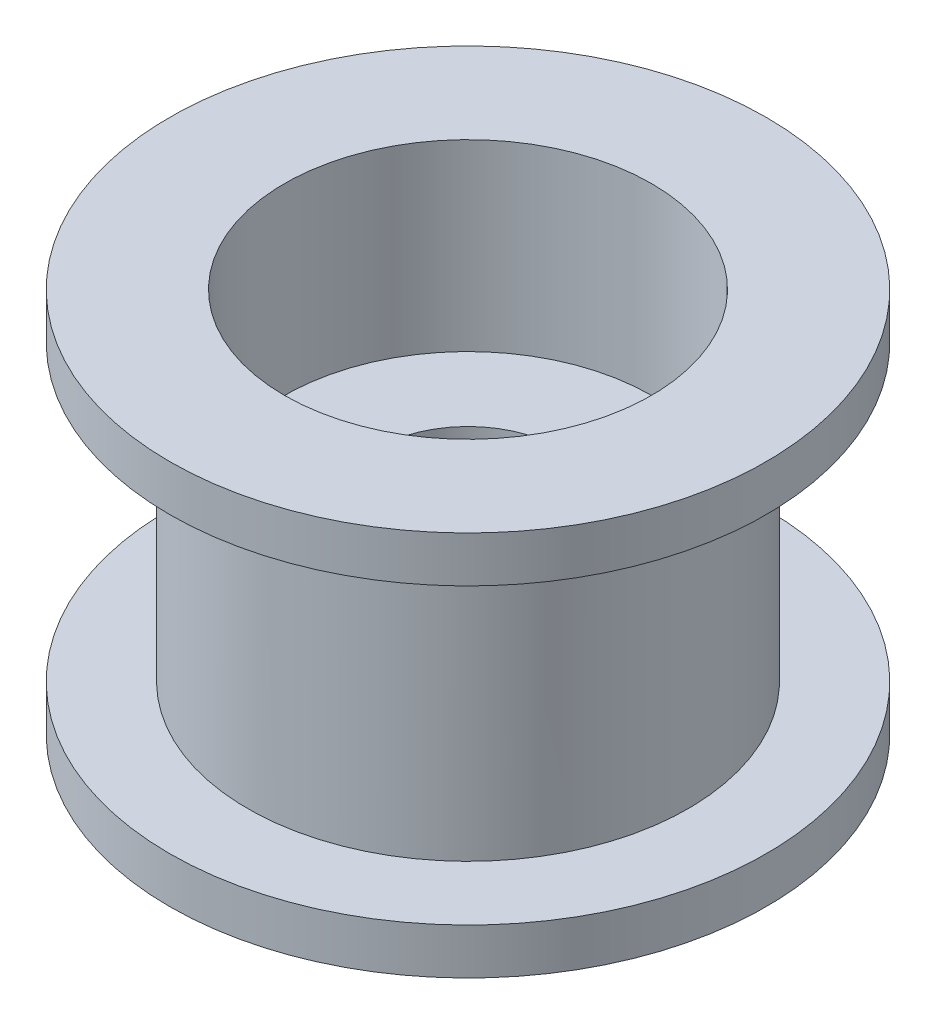
ISO-10303-21;
HEADER;
FILE_DESCRIPTION(('STEP AP214'),'2;1');
FILE_NAME('part.step','',(''),(''),'','','');
FILE_SCHEMA(('AUTOMOTIVE_DESIGN { 1 0 10303 214 1 1 1 1 }'));
ENDSEC;
DATA;
#1=APPLICATION_CONTEXT('core data for automotive mechanical design processes');
#2=APPLICATION_PROTOCOL_DEFINITION('international standard','automotive_design',2000,#1);
#3=PRODUCT_CONTEXT('',#1,'mechanical');
#4=PRODUCT('Part','Part','',(#3));
#5=PRODUCT_RELATED_PRODUCT_CATEGORY('part','',(#4));
#6=PRODUCT_DEFINITION_FORMATION('','',#4);
#7=PRODUCT_DEFINITION_CONTEXT('part definition',#1,'design');
#8=PRODUCT_DEFINITION('design','',#6,#7);
#9=PRODUCT_DEFINITION_SHAPE('','',#8);
#10=(LENGTH_UNIT() NAMED_UNIT(*) SI_UNIT(.MILLI.,.METRE.));
#11=(NAMED_UNIT(*) PLANE_ANGLE_UNIT() SI_UNIT($,.RADIAN.));
#12=(NAMED_UNIT(*) SI_UNIT($,.STERADIAN.) SOLID_ANGLE_UNIT());
#13=UNCERTAINTY_MEASURE_WITH_UNIT(LENGTH_MEASURE(1.E-05),#10,'distance_accuracy_value','');
#14=(GEOMETRIC_REPRESENTATION_CONTEXT(3) GLOBAL_UNCERTAINTY_ASSIGNED_CONTEXT((#13)) GLOBAL_UNIT_ASSIGNED_CONTEXT((#10,
#11,#12)) REPRESENTATION_CONTEXT('',''));
#15=CARTESIAN_POINT('',(0.,0.,0.));
#16=DIRECTION('',(0.,0.,1.));
#17=DIRECTION('',(1.,0.,0.));
#18=AXIS2_PLACEMENT_3D('',#15,#16,#17);
#19=CARTESIAN_POINT('',(0.,-4.2,0.));
#20=DIRECTION('',(0.,-1.,0.));
#21=DIRECTION('',(0.,0.,1.));
#22=AXIS2_PLACEMENT_3D('',#19,#20,#21);
#23=PLANE('',#22);
#24=CARTESIAN_POINT('',(0.,-4.2,0.));
#25=DIRECTION('',(0.,1.,0.));
#26=DIRECTION('',(0.,0.,1.));
#27=AXIS2_PLACEMENT_3D('',#24,#25,#26);
#28=CIRCLE('',#27,6.5);
#29=CARTESIAN_POINT('',(0.,-4.2,6.5));
#30=VERTEX_POINT('',#29);
#31=EDGE_CURVE('E57',#30,#30,#28,.T.);
#32=ORIENTED_EDGE('',*,*,#31,.F.);
#33=EDGE_LOOP('',(#32));
#34=FACE_BOUND('',#33,.T.);
#35=CARTESIAN_POINT('',(0.,-4.2,0.));
#36=DIRECTION('',(0.,1.,0.));
#37=DIRECTION('',(0.,0.,1.));
#38=AXIS2_PLACEMENT_3D('',#35,#36,#37);
#39=CIRCLE('',#38,4.);
#40=CARTESIAN_POINT('',(0.,-4.2,4.));
#41=VERTEX_POINT('',#40);
#42=EDGE_CURVE('E64',#41,#41,#39,.T.);
#43=ORIENTED_EDGE('',*,*,#42,.T.);
#44=EDGE_LOOP('',(#43));
#45=FACE_BOUND('',#44,.T.);
#46=ADVANCED_FACE('F31',(#34,#45),#23,.T.);
#47=CARTESIAN_POINT('',(0.,3.2,0.));
#48=DIRECTION('',(0.,-1.,0.));
#49=DIRECTION('',(0.,0.,-1.));
#50=AXIS2_PLACEMENT_3D('',#47,#48,#49);
#51=CYLINDRICAL_SURFACE('',#50,4.8);
#52=CARTESIAN_POINT('',(0.,3.2,0.));
#53=DIRECTION('',(0.,1.,0.));
#54=DIRECTION('',(0.,0.,1.));
#55=AXIS2_PLACEMENT_3D('',#52,#53,#54);
#56=CIRCLE('',#55,4.8);
#57=CARTESIAN_POINT('',(0.,3.2,4.8));
#58=VERTEX_POINT('',#57);
#59=EDGE_CURVE('E10',#58,#58,#56,.T.);
#60=ORIENTED_EDGE('',*,*,#59,.F.);
#61=EDGE_LOOP('',(#60));
#62=FACE_BOUND('',#61,.T.);
#63=CARTESIAN_POINT('',(0.,-3.2,0.));
#64=DIRECTION('',(0.,-1.,0.));
#65=DIRECTION('',(0.,0.,-1.));
#66=AXIS2_PLACEMENT_3D('',#63,#64,#65);
#67=CIRCLE('',#66,4.8);
#68=CARTESIAN_POINT('',(0.,-3.2,-4.8));
#69=VERTEX_POINT('',#68);
#70=EDGE_CURVE('E52',#69,#69,#67,.T.);
#71=ORIENTED_EDGE('',*,*,#70,.F.);
#72=EDGE_LOOP('',(#71));
#73=FACE_BOUND('',#72,.T.);
#74=ADVANCED_FACE('F33',(#62,#73),#51,.T.);
#75=CARTESIAN_POINT('',(0.,3.2,0.));
#76=DIRECTION('',(0.,1.,0.));
#77=DIRECTION('',(0.,0.,1.));
#78=AXIS2_PLACEMENT_3D('',#75,#76,#77);
#79=PLANE('',#78);
#80=CARTESIAN_POINT('',(0.,3.2,0.));
#81=DIRECTION('',(0.,1.,0.));
#82=DIRECTION('',(0.,0.,1.));
#83=AXIS2_PLACEMENT_3D('',#80,#81,#82);
#84=CIRCLE('',#83,6.5);
#85=CARTESIAN_POINT('',(0.,3.2,6.5));
#86=VERTEX_POINT('',#85);
#87=EDGE_CURVE('E43',#86,#86,#84,.T.);
#88=ORIENTED_EDGE('',*,*,#87,.F.);
#89=EDGE_LOOP('',(#88));
#90=FACE_BOUND('',#89,.T.);
#91=ORIENTED_EDGE('',*,*,#59,.T.);
#92=EDGE_LOOP('',(#91));
#93=FACE_BOUND('',#92,.T.);
#94=ADVANCED_FACE('F97',(#90,#93),#79,.F.);
#95=CARTESIAN_POINT('',(0.,4.2,0.));
#96=DIRECTION('',(0.,-1.,0.));
#97=DIRECTION('',(0.,0.,-1.));
#98=AXIS2_PLACEMENT_3D('',#95,#96,#97);
#99=CYLINDRICAL_SURFACE('',#98,6.5);
#100=CARTESIAN_POINT('',(0.,4.2,0.));
#101=DIRECTION('',(0.,1.,0.));
#102=DIRECTION('',(0.,0.,1.));
#103=AXIS2_PLACEMENT_3D('',#100,#101,#102);
#104=CIRCLE('',#103,6.5);
#105=CARTESIAN_POINT('',(0.,4.2,6.5));
#106=VERTEX_POINT('',#105);
#107=EDGE_CURVE('E39',#106,#106,#104,.T.);
#108=ORIENTED_EDGE('',*,*,#107,.F.);
#109=EDGE_LOOP('',(#108));
#110=FACE_BOUND('',#109,.T.);
#111=ORIENTED_EDGE('',*,*,#87,.T.);
#112=EDGE_LOOP('',(#111));
#113=FACE_BOUND('',#112,.T.);
#114=ADVANCED_FACE('F119',(#110,#113),#99,.T.);
#115=CARTESIAN_POINT('',(0.,4.2,0.));
#116=DIRECTION('',(0.,1.,0.));
#117=DIRECTION('',(0.,0.,1.));
#118=AXIS2_PLACEMENT_3D('',#115,#116,#117);
#119=PLANE('',#118);
#120=CARTESIAN_POINT('',(0.,4.2,0.));
#121=DIRECTION('',(0.,1.,0.));
#122=DIRECTION('',(0.,0.,1.));
#123=AXIS2_PLACEMENT_3D('',#120,#121,#122);
#124=CIRCLE('',#123,4.);
#125=CARTESIAN_POINT('',(0.,4.2,4.));
#126=VERTEX_POINT('',#125);
#127=EDGE_CURVE('E49',#126,#126,#124,.T.);
#128=ORIENTED_EDGE('',*,*,#127,.F.);
#129=EDGE_LOOP('',(#128));
#130=FACE_BOUND('',#129,.T.);
#131=ORIENTED_EDGE('',*,*,#107,.T.);
#132=EDGE_LOOP('',(#131));
#133=FACE_BOUND('',#132,.T.);
#134=ADVANCED_FACE('F115',(#130,#133),#119,.T.);
#135=CARTESIAN_POINT('',(0.,0.200000000000001,0.));
#136=DIRECTION('',(0.,1.,0.));
#137=DIRECTION('',(0.,0.,1.));
#138=AXIS2_PLACEMENT_3D('',#135,#136,#137);
#139=CYLINDRICAL_SURFACE('',#138,4.);
#140=CARTESIAN_POINT('',(0.,0.200000000000001,0.));
#141=DIRECTION('',(0.,1.,0.));
#142=DIRECTION('',(0.,0.,1.));
#143=AXIS2_PLACEMENT_3D('',#140,#141,#142);
#144=CIRCLE('',#143,4.);
#145=CARTESIAN_POINT('',(0.,0.200000000000001,4.));
#146=VERTEX_POINT('',#145);
#147=EDGE_CURVE('E47',#146,#146,#144,.T.);
#148=ORIENTED_EDGE('',*,*,#147,.F.);
#149=EDGE_LOOP('',(#148));
#150=FACE_BOUND('',#149,.T.);
#151=ORIENTED_EDGE('',*,*,#127,.T.);
#152=EDGE_LOOP('',(#151));
#153=FACE_BOUND('',#152,.T.);
#154=ADVANCED_FACE('F111',(#150,#153),#139,.F.);
#155=CARTESIAN_POINT('',(0.,0.200000000000001,0.));
#156=DIRECTION('',(0.,1.,0.));
#157=DIRECTION('',(0.,0.,1.));
#158=AXIS2_PLACEMENT_3D('',#155,#156,#157);
#159=PLANE('',#158);
#160=CARTESIAN_POINT('',(0.,0.200000000000001,0.));
#161=DIRECTION('',(0.,1.,0.));
#162=DIRECTION('',(0.,0.,1.));
#163=AXIS2_PLACEMENT_3D('',#160,#161,#162);
#164=CIRCLE('',#163,2.);
#165=CARTESIAN_POINT('',(0.,0.200000000000001,2.));
#166=VERTEX_POINT('',#165);
#167=EDGE_CURVE('E69',#166,#166,#164,.T.);
#168=ORIENTED_EDGE('',*,*,#167,.F.);
#169=EDGE_LOOP('',(#168));
#170=FACE_BOUND('',#169,.T.);
#171=ORIENTED_EDGE('',*,*,#147,.T.);
#172=EDGE_LOOP('',(#171));
#173=FACE_BOUND('',#172,.T.);
#174=ADVANCED_FACE('F104',(#170,#173),#159,.T.);
#175=CARTESIAN_POINT('',(0.,-3.2,0.));
#176=DIRECTION('',(0.,-1.,0.));
#177=DIRECTION('',(0.,0.,1.));
#178=AXIS2_PLACEMENT_3D('',#175,#176,#177);
#179=PLANE('',#178);
#180=CARTESIAN_POINT('',(0.,-3.2,0.));
#181=DIRECTION('',(0.,1.,0.));
#182=DIRECTION('',(0.,0.,1.));
#183=AXIS2_PLACEMENT_3D('',#180,#181,#182);
#184=CIRCLE('',#183,6.5);
#185=CARTESIAN_POINT('',(0.,-3.2,6.5));
#186=VERTEX_POINT('',#185);
#187=EDGE_CURVE('E58',#186,#186,#184,.T.);
#188=ORIENTED_EDGE('',*,*,#187,.T.);
#189=EDGE_LOOP('',(#188));
#190=FACE_BOUND('',#189,.T.);
#191=ORIENTED_EDGE('',*,*,#70,.T.);
#192=EDGE_LOOP('',(#191));
#193=FACE_BOUND('',#192,.T.);
#194=ADVANCED_FACE('F101',(#190,#193),#179,.F.);
#195=CARTESIAN_POINT('',(0.,-4.2,0.));
#196=DIRECTION('',(0.,1.,0.));
#197=DIRECTION('',(0.,0.,1.));
#198=AXIS2_PLACEMENT_3D('',#195,#196,#197);
#199=CYLINDRICAL_SURFACE('',#198,6.5);
#200=ORIENTED_EDGE('',*,*,#31,.T.);
#201=EDGE_LOOP('',(#200));
#202=FACE_BOUND('',#201,.T.);
#203=ORIENTED_EDGE('',*,*,#187,.F.);
#204=EDGE_LOOP('',(#203));
#205=FACE_BOUND('',#204,.T.);
#206=ADVANCED_FACE('F87',(#202,#205),#199,.T.);
#207=CARTESIAN_POINT('',(0.,-0.200000000000001,0.));
#208=DIRECTION('',(0.,-1.,0.));
#209=DIRECTION('',(0.,0.,-1.));
#210=AXIS2_PLACEMENT_3D('',#207,#208,#209);
#211=CYLINDRICAL_SURFACE('',#210,4.);
#212=CARTESIAN_POINT('',(0.,-0.200000000000001,0.));
#213=DIRECTION('',(0.,1.,0.));
#214=DIRECTION('',(0.,0.,1.));
#215=AXIS2_PLACEMENT_3D('',#212,#213,#214);
#216=CIRCLE('',#215,4.);
#217=CARTESIAN_POINT('',(0.,-0.200000000000001,4.));
#218=VERTEX_POINT('',#217);
#219=EDGE_CURVE('E61',#218,#218,#216,.T.);
#220=ORIENTED_EDGE('',*,*,#219,.T.);
#221=EDGE_LOOP('',(#220));
#222=FACE_BOUND('',#221,.T.);
#223=ORIENTED_EDGE('',*,*,#42,.F.);
#224=EDGE_LOOP('',(#223));
#225=FACE_BOUND('',#224,.T.);
#226=ADVANCED_FACE('F81',(#222,#225),#211,.F.);
#227=CARTESIAN_POINT('',(0.,-0.200000000000001,0.));
#228=DIRECTION('',(0.,-1.,0.));
#229=DIRECTION('',(0.,0.,1.));
#230=AXIS2_PLACEMENT_3D('',#227,#228,#229);
#231=PLANE('',#230);
#232=CARTESIAN_POINT('',(0.,-0.200000000000001,0.));
#233=DIRECTION('',(0.,-1.,0.));
#234=DIRECTION('',(0.,0.,-1.));
#235=AXIS2_PLACEMENT_3D('',#232,#233,#234);
#236=CIRCLE('',#235,2.);
#237=CARTESIAN_POINT('',(0.,-0.200000000000001,-2.));
#238=VERTEX_POINT('',#237);
#239=EDGE_CURVE('E35',#238,#238,#236,.T.);
#240=ORIENTED_EDGE('',*,*,#239,.F.);
#241=EDGE_LOOP('',(#240));
#242=FACE_BOUND('',#241,.T.);
#243=ORIENTED_EDGE('',*,*,#219,.F.);
#244=EDGE_LOOP('',(#243));
#245=FACE_BOUND('',#244,.T.);
#246=ADVANCED_FACE('F78',(#242,#245),#231,.T.);
#247=CARTESIAN_POINT('',(0.,-4.2,0.));
#248=DIRECTION('',(0.,1.,0.));
#249=DIRECTION('',(0.,0.,1.));
#250=AXIS2_PLACEMENT_3D('',#247,#248,#249);
#251=CYLINDRICAL_SURFACE('',#250,2.);
#252=ORIENTED_EDGE('',*,*,#239,.T.);
#253=EDGE_LOOP('',(#252));
#254=FACE_BOUND('',#253,.T.);
#255=ORIENTED_EDGE('',*,*,#167,.T.);
#256=EDGE_LOOP('',(#255));
#257=FACE_BOUND('',#256,.T.);
#258=ADVANCED_FACE('F76',(#254,#257),#251,.F.);
#259=CLOSED_SHELL('',(#46,#74,#94,#114,#134,#154,#174,#194,#206,#226,#246,#258));
#260=MANIFOLD_SOLID_BREP('B2',#259);
#261=ADVANCED_BREP_SHAPE_REPRESENTATION('',(#18,#260),#14);
#262=SHAPE_DEFINITION_REPRESENTATION(#9,#261);
ENDSEC;
END-ISO-10303-21;
